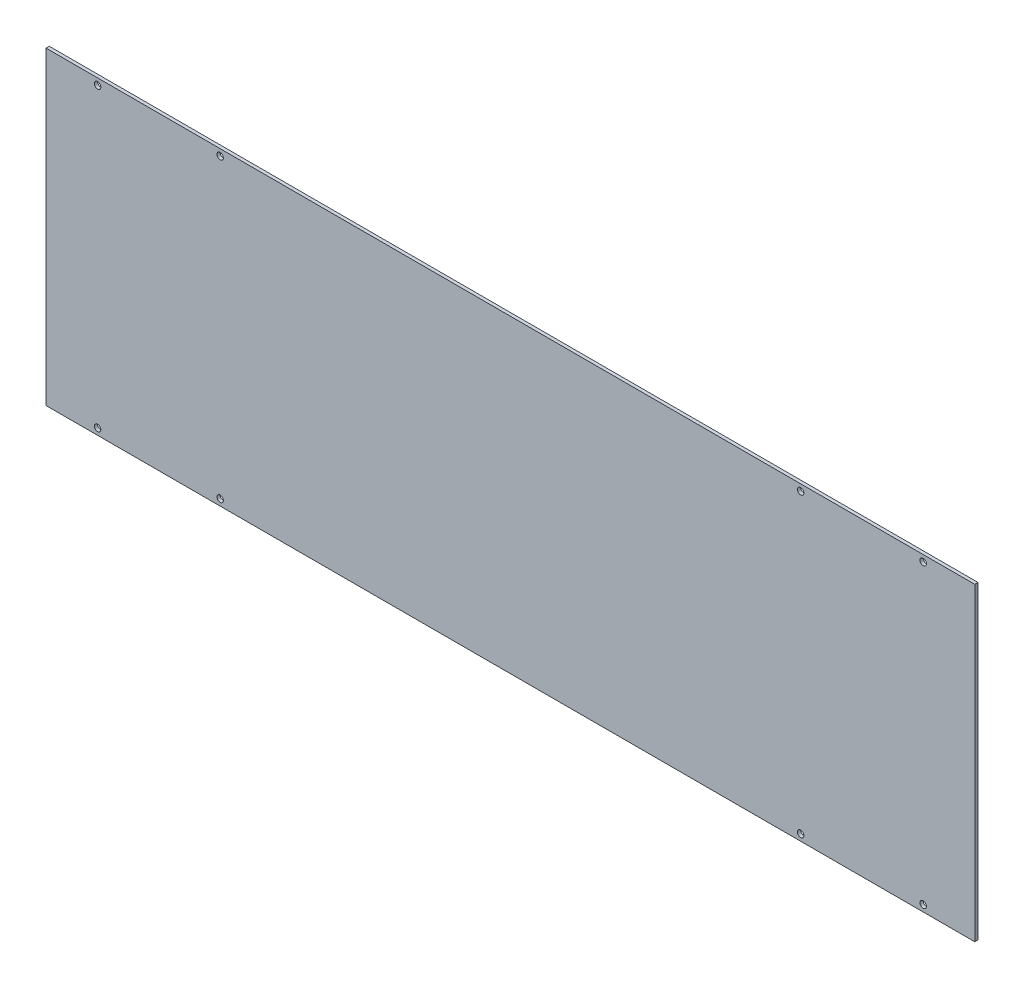
ISO-10303-21;
HEADER;
FILE_DESCRIPTION(('STEP AP214'),'2;1');
FILE_NAME('part.step','',(''),(''),'','','');
FILE_SCHEMA(('AUTOMOTIVE_DESIGN { 1 0 10303 214 1 1 1 1 }'));
ENDSEC;
DATA;
#1=APPLICATION_CONTEXT('core data for automotive mechanical design processes');
#2=APPLICATION_PROTOCOL_DEFINITION('international standard','automotive_design',2000,#1);
#3=PRODUCT_CONTEXT('',#1,'mechanical');
#4=PRODUCT('Part','Part','',(#3));
#5=PRODUCT_RELATED_PRODUCT_CATEGORY('part','',(#4));
#6=PRODUCT_DEFINITION_FORMATION('','',#4);
#7=PRODUCT_DEFINITION_CONTEXT('part definition',#1,'design');
#8=PRODUCT_DEFINITION('design','',#6,#7);
#9=PRODUCT_DEFINITION_SHAPE('','',#8);
#10=(LENGTH_UNIT() NAMED_UNIT(*) SI_UNIT(.MILLI.,.METRE.));
#11=(NAMED_UNIT(*) PLANE_ANGLE_UNIT() SI_UNIT($,.RADIAN.));
#12=(NAMED_UNIT(*) SI_UNIT($,.STERADIAN.) SOLID_ANGLE_UNIT());
#13=UNCERTAINTY_MEASURE_WITH_UNIT(LENGTH_MEASURE(1.E-05),#10,'distance_accuracy_value','');
#14=(GEOMETRIC_REPRESENTATION_CONTEXT(3) GLOBAL_UNCERTAINTY_ASSIGNED_CONTEXT((#13)) GLOBAL_UNIT_ASSIGNED_CONTEXT((#10,
#11,#12)) REPRESENTATION_CONTEXT('',''));
#15=CARTESIAN_POINT('',(0.,0.,0.));
#16=DIRECTION('',(0.,0.,1.));
#17=DIRECTION('',(1.,0.,0.));
#18=AXIS2_PLACEMENT_3D('',#15,#16,#17);
#19=CARTESIAN_POINT('',(0.,0.,0.));
#20=DIRECTION('',(0.,0.,-1.));
#21=DIRECTION('',(-1.,0.,0.));
#22=AXIS2_PLACEMENT_3D('',#19,#20,#21);
#23=PLANE('',#22);
#24=CARTESIAN_POINT('',(-285.75,146.05,0.));
#25=DIRECTION('',(0.,0.,1.));
#26=DIRECTION('',(1.,0.,0.));
#27=AXIS2_PLACEMENT_3D('',#24,#25,#26);
#28=CIRCLE('',#27,3.17499999999998);
#29=CARTESIAN_POINT('',(-282.575,146.05,0.));
#30=VERTEX_POINT('',#29);
#31=EDGE_CURVE('E191',#30,#30,#28,.T.);
#32=ORIENTED_EDGE('',*,*,#31,.T.);
#33=EDGE_LOOP('',(#32));
#34=FACE_BOUND('',#33,.T.);
#35=CARTESIAN_POINT('',(-406.4,146.05,0.));
#36=DIRECTION('',(0.,0.,1.));
#37=DIRECTION('',(1.,0.,0.));
#38=AXIS2_PLACEMENT_3D('',#35,#36,#37);
#39=CIRCLE('',#38,3.17499999999998);
#40=CARTESIAN_POINT('',(-403.225,146.05,0.));
#41=VERTEX_POINT('',#40);
#42=EDGE_CURVE('E183',#41,#41,#39,.T.);
#43=ORIENTED_EDGE('',*,*,#42,.T.);
#44=EDGE_LOOP('',(#43));
#45=FACE_BOUND('',#44,.T.);
#46=DIRECTION('',(0.,1.,0.));
#47=VECTOR('',#46,1.);
#48=CARTESIAN_POINT('',(457.2,-152.4,0.));
#49=LINE('',#48,#47);
#50=CARTESIAN_POINT('',(457.2,-152.4,0.));
#51=VERTEX_POINT('',#50);
#52=CARTESIAN_POINT('',(457.2,152.4,0.));
#53=VERTEX_POINT('',#52);
#54=EDGE_CURVE('E113',#51,#53,#49,.T.);
#55=ORIENTED_EDGE('',*,*,#54,.F.);
#56=DIRECTION('',(1.,0.,0.));
#57=VECTOR('',#56,1.);
#58=CARTESIAN_POINT('',(-457.2,-152.4,0.));
#59=LINE('',#58,#57);
#60=CARTESIAN_POINT('',(-457.2,-152.4,0.));
#61=VERTEX_POINT('',#60);
#62=EDGE_CURVE('E84',#61,#51,#59,.T.);
#63=ORIENTED_EDGE('',*,*,#62,.F.);
#64=DIRECTION('',(0.,-1.,0.));
#65=VECTOR('',#64,1.);
#66=CARTESIAN_POINT('',(-457.2,-152.4,0.));
#67=LINE('',#66,#65);
#68=CARTESIAN_POINT('',(-457.2,152.4,0.));
#69=VERTEX_POINT('',#68);
#70=EDGE_CURVE('E78',#69,#61,#67,.T.);
#71=ORIENTED_EDGE('',*,*,#70,.F.);
#72=DIRECTION('',(-1.,0.,0.));
#73=VECTOR('',#72,1.);
#74=CARTESIAN_POINT('',(-457.2,152.4,0.));
#75=LINE('',#74,#73);
#76=EDGE_CURVE('E101',#53,#69,#75,.T.);
#77=ORIENTED_EDGE('',*,*,#76,.F.);
#78=EDGE_LOOP('',(#55,#63,#71,#77));
#79=FACE_BOUND('',#78,.T.);
#80=CARTESIAN_POINT('',(285.75,-146.05,0.));
#81=DIRECTION('',(0.,0.,1.));
#82=DIRECTION('',(1.,0.,0.));
#83=AXIS2_PLACEMENT_3D('',#80,#81,#82);
#84=CIRCLE('',#83,3.17499999999998);
#85=CARTESIAN_POINT('',(288.925,-146.05,0.));
#86=VERTEX_POINT('',#85);
#87=EDGE_CURVE('E117',#86,#86,#84,.T.);
#88=ORIENTED_EDGE('',*,*,#87,.T.);
#89=EDGE_LOOP('',(#88));
#90=FACE_BOUND('',#89,.T.);
#91=CARTESIAN_POINT('',(406.4,-146.05,0.));
#92=DIRECTION('',(0.,0.,1.));
#93=DIRECTION('',(1.,0.,0.));
#94=AXIS2_PLACEMENT_3D('',#91,#92,#93);
#95=CIRCLE('',#94,3.17499999999998);
#96=CARTESIAN_POINT('',(409.575,-146.05,0.));
#97=VERTEX_POINT('',#96);
#98=EDGE_CURVE('E143',#97,#97,#95,.T.);
#99=ORIENTED_EDGE('',*,*,#98,.T.);
#100=EDGE_LOOP('',(#99));
#101=FACE_BOUND('',#100,.T.);
#102=CARTESIAN_POINT('',(406.4,146.05,0.));
#103=DIRECTION('',(0.,0.,1.));
#104=DIRECTION('',(1.,0.,0.));
#105=AXIS2_PLACEMENT_3D('',#102,#103,#104);
#106=CIRCLE('',#105,3.17499999999998);
#107=CARTESIAN_POINT('',(409.575,146.05,0.));
#108=VERTEX_POINT('',#107);
#109=EDGE_CURVE('E151',#108,#108,#106,.T.);
#110=ORIENTED_EDGE('',*,*,#109,.T.);
#111=EDGE_LOOP('',(#110));
#112=FACE_BOUND('',#111,.T.);
#113=CARTESIAN_POINT('',(285.75,146.05,0.));
#114=DIRECTION('',(0.,0.,1.));
#115=DIRECTION('',(1.,0.,0.));
#116=AXIS2_PLACEMENT_3D('',#113,#114,#115);
#117=CIRCLE('',#116,3.17499999999998);
#118=CARTESIAN_POINT('',(288.925,146.05,0.));
#119=VERTEX_POINT('',#118);
#120=EDGE_CURVE('E159',#119,#119,#117,.T.);
#121=ORIENTED_EDGE('',*,*,#120,.T.);
#122=EDGE_LOOP('',(#121));
#123=FACE_BOUND('',#122,.T.);
#124=CARTESIAN_POINT('',(-285.75,-146.05,0.));
#125=DIRECTION('',(0.,0.,1.));
#126=DIRECTION('',(1.,0.,0.));
#127=AXIS2_PLACEMENT_3D('',#124,#125,#126);
#128=CIRCLE('',#127,3.17499999999998);
#129=CARTESIAN_POINT('',(-282.575,-146.05,0.));
#130=VERTEX_POINT('',#129);
#131=EDGE_CURVE('E167',#130,#130,#128,.T.);
#132=ORIENTED_EDGE('',*,*,#131,.T.);
#133=EDGE_LOOP('',(#132));
#134=FACE_BOUND('',#133,.T.);
#135=CARTESIAN_POINT('',(-406.4,-146.05,0.));
#136=DIRECTION('',(0.,0.,1.));
#137=DIRECTION('',(1.,0.,0.));
#138=AXIS2_PLACEMENT_3D('',#135,#136,#137);
#139=CIRCLE('',#138,3.17499999999998);
#140=CARTESIAN_POINT('',(-403.225,-146.05,0.));
#141=VERTEX_POINT('',#140);
#142=EDGE_CURVE('E175',#141,#141,#139,.T.);
#143=ORIENTED_EDGE('',*,*,#142,.T.);
#144=EDGE_LOOP('',(#143));
#145=FACE_BOUND('',#144,.T.);
#146=ADVANCED_FACE('F43',(#34,#45,#79,#90,#101,#112,#123,#134,#145),#23,.T.);
#147=CARTESIAN_POINT('',(457.2,-152.4,3.175));
#148=DIRECTION('',(-1.,0.,0.));
#149=DIRECTION('',(0.,0.,1.));
#150=AXIS2_PLACEMENT_3D('',#147,#148,#149);
#151=PLANE('',#150);
#152=ORIENTED_EDGE('',*,*,#54,.T.);
#153=DIRECTION('',(0.,0.,-1.));
#154=VECTOR('',#153,1.);
#155=CARTESIAN_POINT('',(457.2,152.4,3.175));
#156=LINE('',#155,#154);
#157=CARTESIAN_POINT('',(457.2,152.4,3.175));
#158=VERTEX_POINT('',#157);
#159=EDGE_CURVE('E11',#158,#53,#156,.T.);
#160=ORIENTED_EDGE('',*,*,#159,.F.);
#161=DIRECTION('',(0.,1.,0.));
#162=VECTOR('',#161,1.);
#163=CARTESIAN_POINT('',(457.2,-152.4,3.175));
#164=LINE('',#163,#162);
#165=CARTESIAN_POINT('',(457.2,-152.4,3.175));
#166=VERTEX_POINT('',#165);
#167=EDGE_CURVE('E96',#166,#158,#164,.T.);
#168=ORIENTED_EDGE('',*,*,#167,.F.);
#169=DIRECTION('',(0.,0.,-1.));
#170=VECTOR('',#169,1.);
#171=CARTESIAN_POINT('',(457.2,-152.4,3.175));
#172=LINE('',#171,#170);
#173=EDGE_CURVE('E109',#166,#51,#172,.T.);
#174=ORIENTED_EDGE('',*,*,#173,.T.);
#175=EDGE_LOOP('',(#152,#160,#168,#174));
#176=FACE_BOUND('',#175,.T.);
#177=ADVANCED_FACE('F45',(#176),#151,.F.);
#178=CARTESIAN_POINT('',(-457.2,152.4,3.175));
#179=DIRECTION('',(0.,-1.,0.));
#180=DIRECTION('',(0.,0.,-1.));
#181=AXIS2_PLACEMENT_3D('',#178,#179,#180);
#182=PLANE('',#181);
#183=ORIENTED_EDGE('',*,*,#76,.T.);
#184=DIRECTION('',(0.,0.,-1.));
#185=VECTOR('',#184,1.);
#186=CARTESIAN_POINT('',(-457.2,152.4,3.175));
#187=LINE('',#186,#185);
#188=CARTESIAN_POINT('',(-457.2,152.4,3.175));
#189=VERTEX_POINT('',#188);
#190=EDGE_CURVE('E53',#189,#69,#187,.T.);
#191=ORIENTED_EDGE('',*,*,#190,.F.);
#192=DIRECTION('',(-1.,0.,0.));
#193=VECTOR('',#192,1.);
#194=CARTESIAN_POINT('',(-457.2,152.4,3.175));
#195=LINE('',#194,#193);
#196=EDGE_CURVE('E91',#158,#189,#195,.T.);
#197=ORIENTED_EDGE('',*,*,#196,.F.);
#198=ORIENTED_EDGE('',*,*,#159,.T.);
#199=EDGE_LOOP('',(#183,#191,#197,#198));
#200=FACE_BOUND('',#199,.T.);
#201=ADVANCED_FACE('F100',(#200),#182,.F.);
#202=CARTESIAN_POINT('',(-457.2,-152.4,3.175));
#203=DIRECTION('',(1.,0.,0.));
#204=DIRECTION('',(0.,0.,-1.));
#205=AXIS2_PLACEMENT_3D('',#202,#203,#204);
#206=PLANE('',#205);
#207=ORIENTED_EDGE('',*,*,#70,.T.);
#208=DIRECTION('',(0.,0.,-1.));
#209=VECTOR('',#208,1.);
#210=CARTESIAN_POINT('',(-457.2,-152.4,3.175));
#211=LINE('',#210,#209);
#212=CARTESIAN_POINT('',(-457.2,-152.4,3.175));
#213=VERTEX_POINT('',#212);
#214=EDGE_CURVE('E103',#213,#61,#211,.T.);
#215=ORIENTED_EDGE('',*,*,#214,.F.);
#216=DIRECTION('',(0.,-1.,0.));
#217=VECTOR('',#216,1.);
#218=CARTESIAN_POINT('',(-457.2,-152.4,3.175));
#219=LINE('',#218,#217);
#220=EDGE_CURVE('E94',#189,#213,#219,.T.);
#221=ORIENTED_EDGE('',*,*,#220,.F.);
#222=ORIENTED_EDGE('',*,*,#190,.T.);
#223=EDGE_LOOP('',(#207,#215,#221,#222));
#224=FACE_BOUND('',#223,.T.);
#225=ADVANCED_FACE('F104',(#224),#206,.F.);
#226=CARTESIAN_POINT('',(-457.2,-152.4,3.175));
#227=DIRECTION('',(0.,1.,0.));
#228=DIRECTION('',(0.,0.,1.));
#229=AXIS2_PLACEMENT_3D('',#226,#227,#228);
#230=PLANE('',#229);
#231=ORIENTED_EDGE('',*,*,#62,.T.);
#232=ORIENTED_EDGE('',*,*,#173,.F.);
#233=DIRECTION('',(1.,0.,0.));
#234=VECTOR('',#233,1.);
#235=CARTESIAN_POINT('',(-457.2,-152.4,3.175));
#236=LINE('',#235,#234);
#237=EDGE_CURVE('E61',#213,#166,#236,.T.);
#238=ORIENTED_EDGE('',*,*,#237,.F.);
#239=ORIENTED_EDGE('',*,*,#214,.T.);
#240=EDGE_LOOP('',(#231,#232,#238,#239));
#241=FACE_BOUND('',#240,.T.);
#242=ADVANCED_FACE('F128',(#241),#230,.F.);
#243=CARTESIAN_POINT('',(0.,0.,3.175));
#244=DIRECTION('',(0.,0.,-1.));
#245=DIRECTION('',(-1.,0.,0.));
#246=AXIS2_PLACEMENT_3D('',#243,#244,#245);
#247=PLANE('',#246);
#248=CARTESIAN_POINT('',(-285.75,146.05,3.175));
#249=DIRECTION('',(0.,0.,1.));
#250=DIRECTION('',(1.,0.,0.));
#251=AXIS2_PLACEMENT_3D('',#248,#249,#250);
#252=CIRCLE('',#251,3.17499999999998);
#253=CARTESIAN_POINT('',(-282.575,146.05,3.175));
#254=VERTEX_POINT('',#253);
#255=EDGE_CURVE('E195',#254,#254,#252,.T.);
#256=ORIENTED_EDGE('',*,*,#255,.F.);
#257=EDGE_LOOP('',(#256));
#258=FACE_BOUND('',#257,.T.);
#259=CARTESIAN_POINT('',(-406.4,146.05,3.175));
#260=DIRECTION('',(0.,0.,1.));
#261=DIRECTION('',(1.,0.,0.));
#262=AXIS2_PLACEMENT_3D('',#259,#260,#261);
#263=CIRCLE('',#262,3.17499999999998);
#264=CARTESIAN_POINT('',(-403.225,146.05,3.175));
#265=VERTEX_POINT('',#264);
#266=EDGE_CURVE('E187',#265,#265,#263,.T.);
#267=ORIENTED_EDGE('',*,*,#266,.F.);
#268=EDGE_LOOP('',(#267));
#269=FACE_BOUND('',#268,.T.);
#270=CARTESIAN_POINT('',(-406.4,-146.05,3.175));
#271=DIRECTION('',(0.,0.,1.));
#272=DIRECTION('',(1.,0.,0.));
#273=AXIS2_PLACEMENT_3D('',#270,#271,#272);
#274=CIRCLE('',#273,3.17499999999998);
#275=CARTESIAN_POINT('',(-403.225,-146.05,3.175));
#276=VERTEX_POINT('',#275);
#277=EDGE_CURVE('E179',#276,#276,#274,.T.);
#278=ORIENTED_EDGE('',*,*,#277,.F.);
#279=EDGE_LOOP('',(#278));
#280=FACE_BOUND('',#279,.T.);
#281=CARTESIAN_POINT('',(-285.75,-146.05,3.175));
#282=DIRECTION('',(0.,0.,1.));
#283=DIRECTION('',(1.,0.,0.));
#284=AXIS2_PLACEMENT_3D('',#281,#282,#283);
#285=CIRCLE('',#284,3.17499999999998);
#286=CARTESIAN_POINT('',(-282.575,-146.05,3.175));
#287=VERTEX_POINT('',#286);
#288=EDGE_CURVE('E171',#287,#287,#285,.T.);
#289=ORIENTED_EDGE('',*,*,#288,.F.);
#290=EDGE_LOOP('',(#289));
#291=FACE_BOUND('',#290,.T.);
#292=CARTESIAN_POINT('',(285.75,146.05,3.175));
#293=DIRECTION('',(0.,0.,1.));
#294=DIRECTION('',(1.,0.,0.));
#295=AXIS2_PLACEMENT_3D('',#292,#293,#294);
#296=CIRCLE('',#295,3.17499999999998);
#297=CARTESIAN_POINT('',(288.925,146.05,3.175));
#298=VERTEX_POINT('',#297);
#299=EDGE_CURVE('E163',#298,#298,#296,.T.);
#300=ORIENTED_EDGE('',*,*,#299,.F.);
#301=EDGE_LOOP('',(#300));
#302=FACE_BOUND('',#301,.T.);
#303=CARTESIAN_POINT('',(406.4,146.05,3.175));
#304=DIRECTION('',(0.,0.,1.));
#305=DIRECTION('',(1.,0.,0.));
#306=AXIS2_PLACEMENT_3D('',#303,#304,#305);
#307=CIRCLE('',#306,3.17499999999998);
#308=CARTESIAN_POINT('',(409.575,146.05,3.175));
#309=VERTEX_POINT('',#308);
#310=EDGE_CURVE('E155',#309,#309,#307,.T.);
#311=ORIENTED_EDGE('',*,*,#310,.F.);
#312=EDGE_LOOP('',(#311));
#313=FACE_BOUND('',#312,.T.);
#314=CARTESIAN_POINT('',(406.4,-146.05,3.175));
#315=DIRECTION('',(0.,0.,1.));
#316=DIRECTION('',(1.,0.,0.));
#317=AXIS2_PLACEMENT_3D('',#314,#315,#316);
#318=CIRCLE('',#317,3.17499999999998);
#319=CARTESIAN_POINT('',(409.575,-146.05,3.175));
#320=VERTEX_POINT('',#319);
#321=EDGE_CURVE('E147',#320,#320,#318,.T.);
#322=ORIENTED_EDGE('',*,*,#321,.F.);
#323=EDGE_LOOP('',(#322));
#324=FACE_BOUND('',#323,.T.);
#325=CARTESIAN_POINT('',(285.75,-146.05,3.175));
#326=DIRECTION('',(0.,0.,1.));
#327=DIRECTION('',(1.,0.,0.));
#328=AXIS2_PLACEMENT_3D('',#325,#326,#327);
#329=CIRCLE('',#328,3.17499999999998);
#330=CARTESIAN_POINT('',(288.925,-146.05,3.175));
#331=VERTEX_POINT('',#330);
#332=EDGE_CURVE('E139',#331,#331,#329,.T.);
#333=ORIENTED_EDGE('',*,*,#332,.F.);
#334=EDGE_LOOP('',(#333));
#335=FACE_BOUND('',#334,.T.);
#336=ORIENTED_EDGE('',*,*,#167,.T.);
#337=ORIENTED_EDGE('',*,*,#196,.T.);
#338=ORIENTED_EDGE('',*,*,#220,.T.);
#339=ORIENTED_EDGE('',*,*,#237,.T.);
#340=EDGE_LOOP('',(#336,#337,#338,#339));
#341=FACE_BOUND('',#340,.T.);
#342=ADVANCED_FACE('F92',(#258,#269,#280,#291,#302,#313,#324,#335,#341),#247,.F.);
#343=CARTESIAN_POINT('',(285.75,-146.05,3.175));
#344=DIRECTION('',(0.,0.,1.));
#345=DIRECTION('',(1.,0.,0.));
#346=AXIS2_PLACEMENT_3D('',#343,#344,#345);
#347=CYLINDRICAL_SURFACE('',#346,3.17499999999998);
#348=ORIENTED_EDGE('',*,*,#87,.F.);
#349=EDGE_LOOP('',(#348));
#350=FACE_BOUND('',#349,.T.);
#351=ORIENTED_EDGE('',*,*,#332,.T.);
#352=EDGE_LOOP('',(#351));
#353=FACE_BOUND('',#352,.T.);
#354=ADVANCED_FACE('F205',(#350,#353),#347,.F.);
#355=CARTESIAN_POINT('',(406.4,-146.05,3.175));
#356=DIRECTION('',(0.,0.,1.));
#357=DIRECTION('',(1.,0.,0.));
#358=AXIS2_PLACEMENT_3D('',#355,#356,#357);
#359=CYLINDRICAL_SURFACE('',#358,3.17499999999998);
#360=ORIENTED_EDGE('',*,*,#98,.F.);
#361=EDGE_LOOP('',(#360));
#362=FACE_BOUND('',#361,.T.);
#363=ORIENTED_EDGE('',*,*,#321,.T.);
#364=EDGE_LOOP('',(#363));
#365=FACE_BOUND('',#364,.T.);
#366=ADVANCED_FACE('F222',(#362,#365),#359,.F.);
#367=CARTESIAN_POINT('',(406.4,146.05,3.175));
#368=DIRECTION('',(0.,0.,1.));
#369=DIRECTION('',(1.,0.,0.));
#370=AXIS2_PLACEMENT_3D('',#367,#368,#369);
#371=CYLINDRICAL_SURFACE('',#370,3.17499999999998);
#372=ORIENTED_EDGE('',*,*,#109,.F.);
#373=EDGE_LOOP('',(#372));
#374=FACE_BOUND('',#373,.T.);
#375=ORIENTED_EDGE('',*,*,#310,.T.);
#376=EDGE_LOOP('',(#375));
#377=FACE_BOUND('',#376,.T.);
#378=ADVANCED_FACE('F228',(#374,#377),#371,.F.);
#379=CARTESIAN_POINT('',(285.75,146.05,3.175));
#380=DIRECTION('',(0.,0.,1.));
#381=DIRECTION('',(1.,0.,0.));
#382=AXIS2_PLACEMENT_3D('',#379,#380,#381);
#383=CYLINDRICAL_SURFACE('',#382,3.17499999999998);
#384=ORIENTED_EDGE('',*,*,#120,.F.);
#385=EDGE_LOOP('',(#384));
#386=FACE_BOUND('',#385,.T.);
#387=ORIENTED_EDGE('',*,*,#299,.T.);
#388=EDGE_LOOP('',(#387));
#389=FACE_BOUND('',#388,.T.);
#390=ADVANCED_FACE('F275',(#386,#389),#383,.F.);
#391=CARTESIAN_POINT('',(-285.75,-146.05,3.175));
#392=DIRECTION('',(0.,0.,1.));
#393=DIRECTION('',(1.,0.,0.));
#394=AXIS2_PLACEMENT_3D('',#391,#392,#393);
#395=CYLINDRICAL_SURFACE('',#394,3.17499999999998);
#396=ORIENTED_EDGE('',*,*,#131,.F.);
#397=EDGE_LOOP('',(#396));
#398=FACE_BOUND('',#397,.T.);
#399=ORIENTED_EDGE('',*,*,#288,.T.);
#400=EDGE_LOOP('',(#399));
#401=FACE_BOUND('',#400,.T.);
#402=ADVANCED_FACE('F269',(#398,#401),#395,.F.);
#403=CARTESIAN_POINT('',(-406.4,-146.05,3.175));
#404=DIRECTION('',(0.,0.,1.));
#405=DIRECTION('',(1.,0.,0.));
#406=AXIS2_PLACEMENT_3D('',#403,#404,#405);
#407=CYLINDRICAL_SURFACE('',#406,3.17499999999998);
#408=ORIENTED_EDGE('',*,*,#142,.F.);
#409=EDGE_LOOP('',(#408));
#410=FACE_BOUND('',#409,.T.);
#411=ORIENTED_EDGE('',*,*,#277,.T.);
#412=EDGE_LOOP('',(#411));
#413=FACE_BOUND('',#412,.T.);
#414=ADVANCED_FACE('F274',(#410,#413),#407,.F.);
#415=CARTESIAN_POINT('',(-406.4,146.05,3.175));
#416=DIRECTION('',(0.,0.,1.));
#417=DIRECTION('',(1.,0.,0.));
#418=AXIS2_PLACEMENT_3D('',#415,#416,#417);
#419=CYLINDRICAL_SURFACE('',#418,3.17499999999998);
#420=ORIENTED_EDGE('',*,*,#42,.F.);
#421=EDGE_LOOP('',(#420));
#422=FACE_BOUND('',#421,.T.);
#423=ORIENTED_EDGE('',*,*,#266,.T.);
#424=EDGE_LOOP('',(#423));
#425=FACE_BOUND('',#424,.T.);
#426=ADVANCED_FACE('F286',(#422,#425),#419,.F.);
#427=CARTESIAN_POINT('',(-285.75,146.05,3.175));
#428=DIRECTION('',(0.,0.,1.));
#429=DIRECTION('',(1.,0.,0.));
#430=AXIS2_PLACEMENT_3D('',#427,#428,#429);
#431=CYLINDRICAL_SURFACE('',#430,3.17499999999998);
#432=ORIENTED_EDGE('',*,*,#31,.F.);
#433=EDGE_LOOP('',(#432));
#434=FACE_BOUND('',#433,.T.);
#435=ORIENTED_EDGE('',*,*,#255,.T.);
#436=EDGE_LOOP('',(#435));
#437=FACE_BOUND('',#436,.T.);
#438=ADVANCED_FACE('F201',(#434,#437),#431,.F.);
#439=CLOSED_SHELL('',(#146,#177,#201,#225,#242,#342,#354,#366,#378,#390,#402,#414,#426,#438));
#440=MANIFOLD_SOLID_BREP('B2',#439);
#441=ADVANCED_BREP_SHAPE_REPRESENTATION('',(#18,#440),#14);
#442=SHAPE_DEFINITION_REPRESENTATION(#9,#441);
ENDSEC;
END-ISO-10303-21;
